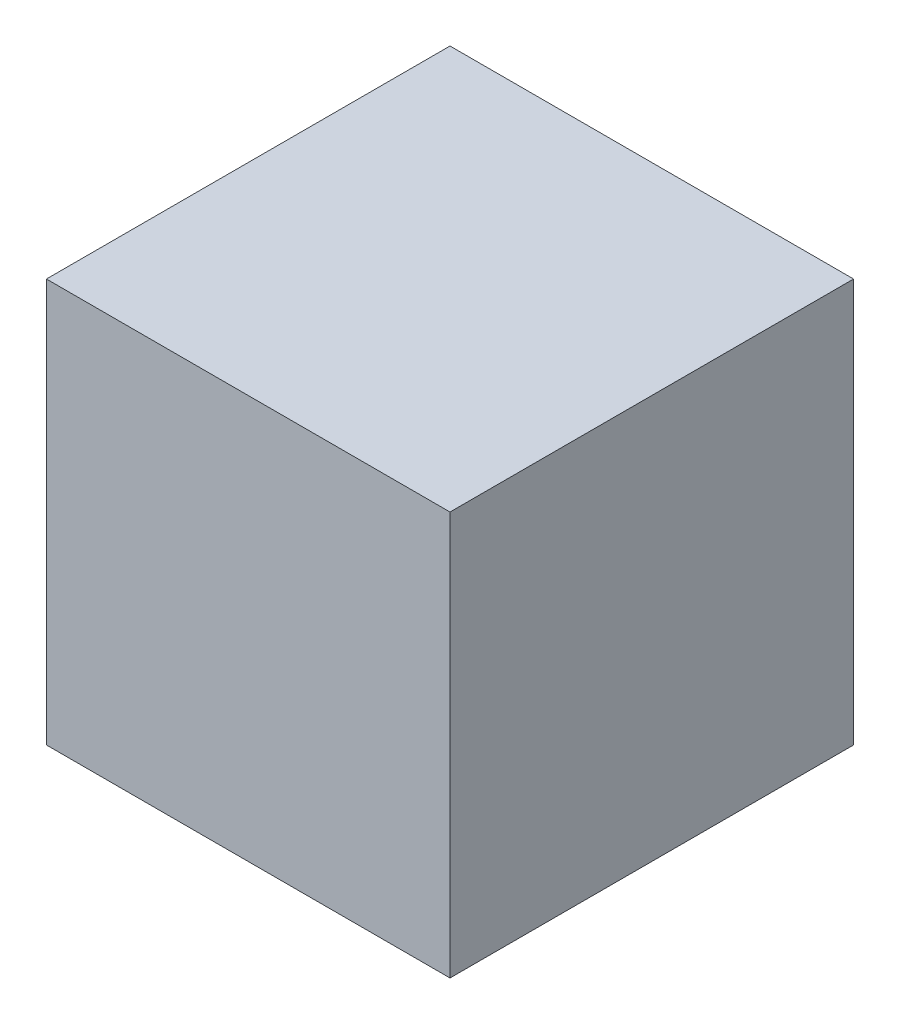
ISO-10303-21;
HEADER;
FILE_DESCRIPTION(('STEP AP214'),'2;1');
FILE_NAME('part.step','',(''),(''),'','','');
FILE_SCHEMA(('AUTOMOTIVE_DESIGN { 1 0 10303 214 1 1 1 1 }'));
ENDSEC;
DATA;
#1=APPLICATION_CONTEXT('core data for automotive mechanical design processes');
#2=APPLICATION_PROTOCOL_DEFINITION('international standard','automotive_design',2000,#1);
#3=PRODUCT_CONTEXT('',#1,'mechanical');
#4=PRODUCT('Part','Part','',(#3));
#5=PRODUCT_RELATED_PRODUCT_CATEGORY('part','',(#4));
#6=PRODUCT_DEFINITION_FORMATION('','',#4);
#7=PRODUCT_DEFINITION_CONTEXT('part definition',#1,'design');
#8=PRODUCT_DEFINITION('design','',#6,#7);
#9=PRODUCT_DEFINITION_SHAPE('','',#8);
#10=(LENGTH_UNIT() NAMED_UNIT(*) SI_UNIT(.MILLI.,.METRE.));
#11=(NAMED_UNIT(*) PLANE_ANGLE_UNIT() SI_UNIT($,.RADIAN.));
#12=(NAMED_UNIT(*) SI_UNIT($,.STERADIAN.) SOLID_ANGLE_UNIT());
#13=UNCERTAINTY_MEASURE_WITH_UNIT(LENGTH_MEASURE(1.E-05),#10,'distance_accuracy_value','');
#14=(GEOMETRIC_REPRESENTATION_CONTEXT(3) GLOBAL_UNCERTAINTY_ASSIGNED_CONTEXT((#13)) GLOBAL_UNIT_ASSIGNED_CONTEXT((#10,
#11,#12)) REPRESENTATION_CONTEXT('',''));
#15=CARTESIAN_POINT('',(0.,0.,0.));
#16=DIRECTION('',(0.,0.,1.));
#17=DIRECTION('',(1.,0.,0.));
#18=AXIS2_PLACEMENT_3D('',#15,#16,#17);
#19=CARTESIAN_POINT('',(50.,-50.,100.));
#20=DIRECTION('',(-1.,0.,0.));
#21=DIRECTION('',(0.,0.,1.));
#22=AXIS2_PLACEMENT_3D('',#19,#20,#21);
#23=PLANE('',#22);
#24=DIRECTION('',(0.,1.,0.));
#25=VECTOR('',#24,1.);
#26=CARTESIAN_POINT('',(50.,-50.,0.));
#27=LINE('',#26,#25);
#28=CARTESIAN_POINT('',(50.,-50.,0.));
#29=VERTEX_POINT('',#28);
#30=CARTESIAN_POINT('',(50.,50.,0.));
#31=VERTEX_POINT('',#30);
#32=EDGE_CURVE('E109',#29,#31,#27,.T.);
#33=ORIENTED_EDGE('',*,*,#32,.T.);
#34=DIRECTION('',(0.,0.,-1.));
#35=VECTOR('',#34,1.);
#36=CARTESIAN_POINT('',(50.,50.,100.));
#37=LINE('',#36,#35);
#38=CARTESIAN_POINT('',(50.,50.,100.));
#39=VERTEX_POINT('',#38);
#40=EDGE_CURVE('E11',#39,#31,#37,.T.);
#41=ORIENTED_EDGE('',*,*,#40,.F.);
#42=DIRECTION('',(0.,1.,0.));
#43=VECTOR('',#42,1.);
#44=CARTESIAN_POINT('',(50.,-50.,100.));
#45=LINE('',#44,#43);
#46=CARTESIAN_POINT('',(50.,-50.,100.));
#47=VERTEX_POINT('',#46);
#48=EDGE_CURVE('E93',#47,#39,#45,.T.);
#49=ORIENTED_EDGE('',*,*,#48,.F.);
#50=DIRECTION('',(0.,0.,-1.));
#51=VECTOR('',#50,1.);
#52=CARTESIAN_POINT('',(50.,-50.,100.));
#53=LINE('',#52,#51);
#54=EDGE_CURVE('E105',#47,#29,#53,.T.);
#55=ORIENTED_EDGE('',*,*,#54,.T.);
#56=EDGE_LOOP('',(#33,#41,#49,#55));
#57=FACE_BOUND('',#56,.T.);
#58=ADVANCED_FACE('F41',(#57),#23,.F.);
#59=CARTESIAN_POINT('',(-50.,50.,100.));
#60=DIRECTION('',(0.,-1.,0.));
#61=DIRECTION('',(0.,0.,-1.));
#62=AXIS2_PLACEMENT_3D('',#59,#60,#61);
#63=PLANE('',#62);
#64=DIRECTION('',(-1.,0.,0.));
#65=VECTOR('',#64,1.);
#66=CARTESIAN_POINT('',(-50.,50.,0.));
#67=LINE('',#66,#65);
#68=CARTESIAN_POINT('',(-50.,50.,0.));
#69=VERTEX_POINT('',#68);
#70=EDGE_CURVE('E98',#31,#69,#67,.T.);
#71=ORIENTED_EDGE('',*,*,#70,.T.);
#72=DIRECTION('',(0.,0.,-1.));
#73=VECTOR('',#72,1.);
#74=CARTESIAN_POINT('',(-50.,50.,100.));
#75=LINE('',#74,#73);
#76=CARTESIAN_POINT('',(-50.,50.,100.));
#77=VERTEX_POINT('',#76);
#78=EDGE_CURVE('E50',#77,#69,#75,.T.);
#79=ORIENTED_EDGE('',*,*,#78,.F.);
#80=DIRECTION('',(-1.,0.,0.));
#81=VECTOR('',#80,1.);
#82=CARTESIAN_POINT('',(-50.,50.,100.));
#83=LINE('',#82,#81);
#84=EDGE_CURVE('E88',#39,#77,#83,.T.);
#85=ORIENTED_EDGE('',*,*,#84,.F.);
#86=ORIENTED_EDGE('',*,*,#40,.T.);
#87=EDGE_LOOP('',(#71,#79,#85,#86));
#88=FACE_BOUND('',#87,.T.);
#89=ADVANCED_FACE('F97',(#88),#63,.F.);
#90=CARTESIAN_POINT('',(-50.,-50.,100.));
#91=DIRECTION('',(1.,0.,0.));
#92=DIRECTION('',(0.,0.,-1.));
#93=AXIS2_PLACEMENT_3D('',#90,#91,#92);
#94=PLANE('',#93);
#95=DIRECTION('',(0.,-1.,0.));
#96=VECTOR('',#95,1.);
#97=CARTESIAN_POINT('',(-50.,-50.,0.));
#98=LINE('',#97,#96);
#99=CARTESIAN_POINT('',(-50.,-50.,0.));
#100=VERTEX_POINT('',#99);
#101=EDGE_CURVE('E75',#69,#100,#98,.T.);
#102=ORIENTED_EDGE('',*,*,#101,.T.);
#103=DIRECTION('',(0.,0.,-1.));
#104=VECTOR('',#103,1.);
#105=CARTESIAN_POINT('',(-50.,-50.,100.));
#106=LINE('',#105,#104);
#107=CARTESIAN_POINT('',(-50.,-50.,100.));
#108=VERTEX_POINT('',#107);
#109=EDGE_CURVE('E100',#108,#100,#106,.T.);
#110=ORIENTED_EDGE('',*,*,#109,.F.);
#111=DIRECTION('',(0.,-1.,0.));
#112=VECTOR('',#111,1.);
#113=CARTESIAN_POINT('',(-50.,-50.,100.));
#114=LINE('',#113,#112);
#115=EDGE_CURVE('E91',#77,#108,#114,.T.);
#116=ORIENTED_EDGE('',*,*,#115,.F.);
#117=ORIENTED_EDGE('',*,*,#78,.T.);
#118=EDGE_LOOP('',(#102,#110,#116,#117));
#119=FACE_BOUND('',#118,.T.);
#120=ADVANCED_FACE('F101',(#119),#94,.F.);
#121=CARTESIAN_POINT('',(-50.,-50.,100.));
#122=DIRECTION('',(0.,1.,0.));
#123=DIRECTION('',(0.,0.,1.));
#124=AXIS2_PLACEMENT_3D('',#121,#122,#123);
#125=PLANE('',#124);
#126=DIRECTION('',(1.,0.,0.));
#127=VECTOR('',#126,1.);
#128=CARTESIAN_POINT('',(-50.,-50.,0.));
#129=LINE('',#128,#127);
#130=EDGE_CURVE('E81',#100,#29,#129,.T.);
#131=ORIENTED_EDGE('',*,*,#130,.T.);
#132=ORIENTED_EDGE('',*,*,#54,.F.);
#133=DIRECTION('',(1.,0.,0.));
#134=VECTOR('',#133,1.);
#135=CARTESIAN_POINT('',(-50.,-50.,100.));
#136=LINE('',#135,#134);
#137=EDGE_CURVE('E58',#108,#47,#136,.T.);
#138=ORIENTED_EDGE('',*,*,#137,.F.);
#139=ORIENTED_EDGE('',*,*,#109,.T.);
#140=EDGE_LOOP('',(#131,#132,#138,#139));
#141=FACE_BOUND('',#140,.T.);
#142=ADVANCED_FACE('F122',(#141),#125,.F.);
#143=CARTESIAN_POINT('',(0.,0.,100.));
#144=DIRECTION('',(0.,0.,-1.));
#145=DIRECTION('',(-1.,0.,0.));
#146=AXIS2_PLACEMENT_3D('',#143,#144,#145);
#147=PLANE('',#146);
#148=ORIENTED_EDGE('',*,*,#48,.T.);
#149=ORIENTED_EDGE('',*,*,#84,.T.);
#150=ORIENTED_EDGE('',*,*,#115,.T.);
#151=ORIENTED_EDGE('',*,*,#137,.T.);
#152=EDGE_LOOP('',(#148,#149,#150,#151));
#153=FACE_BOUND('',#152,.T.);
#154=ADVANCED_FACE('F89',(#153),#147,.F.);
#155=CARTESIAN_POINT('',(0.,0.,0.));
#156=DIRECTION('',(0.,0.,-1.));
#157=DIRECTION('',(-1.,0.,0.));
#158=AXIS2_PLACEMENT_3D('',#155,#156,#157);
#159=PLANE('',#158);
#160=ORIENTED_EDGE('',*,*,#32,.F.);
#161=ORIENTED_EDGE('',*,*,#130,.F.);
#162=ORIENTED_EDGE('',*,*,#101,.F.);
#163=ORIENTED_EDGE('',*,*,#70,.F.);
#164=EDGE_LOOP('',(#160,#161,#162,#163));
#165=FACE_BOUND('',#164,.T.);
#166=ADVANCED_FACE('F125',(#165),#159,.T.);
#167=CLOSED_SHELL('',(#58,#89,#120,#142,#154,#166));
#168=MANIFOLD_SOLID_BREP('B2',#167);
#169=ADVANCED_BREP_SHAPE_REPRESENTATION('',(#18,#168),#14);
#170=SHAPE_DEFINITION_REPRESENTATION(#9,#169);
ENDSEC;
END-ISO-10303-21;
